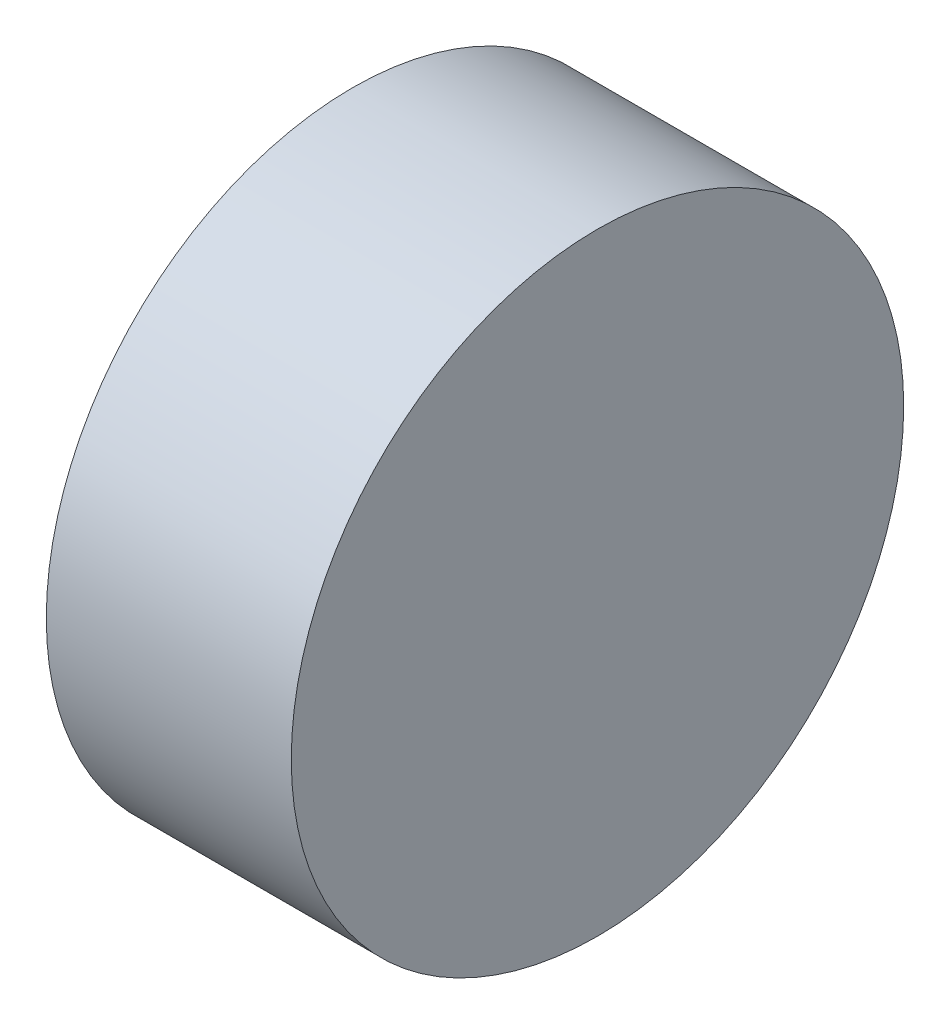
ISO-10303-21;
HEADER;
FILE_DESCRIPTION(('STEP AP214'),'2;1');
FILE_NAME('part.step','',(''),(''),'','','');
FILE_SCHEMA(('AUTOMOTIVE_DESIGN { 1 0 10303 214 1 1 1 1 }'));
ENDSEC;
DATA;
#1=APPLICATION_CONTEXT('core data for automotive mechanical design processes');
#2=APPLICATION_PROTOCOL_DEFINITION('international standard','automotive_design',2000,#1);
#3=PRODUCT_CONTEXT('',#1,'mechanical');
#4=PRODUCT('Part','Part','',(#3));
#5=PRODUCT_RELATED_PRODUCT_CATEGORY('part','',(#4));
#6=PRODUCT_DEFINITION_FORMATION('','',#4);
#7=PRODUCT_DEFINITION_CONTEXT('part definition',#1,'design');
#8=PRODUCT_DEFINITION('design','',#6,#7);
#9=PRODUCT_DEFINITION_SHAPE('','',#8);
#10=(LENGTH_UNIT() NAMED_UNIT(*) SI_UNIT(.MILLI.,.METRE.));
#11=(NAMED_UNIT(*) PLANE_ANGLE_UNIT() SI_UNIT($,.RADIAN.));
#12=(NAMED_UNIT(*) SI_UNIT($,.STERADIAN.) SOLID_ANGLE_UNIT());
#13=UNCERTAINTY_MEASURE_WITH_UNIT(LENGTH_MEASURE(1.E-05),#10,'distance_accuracy_value','');
#14=(GEOMETRIC_REPRESENTATION_CONTEXT(3) GLOBAL_UNCERTAINTY_ASSIGNED_CONTEXT((#13)) GLOBAL_UNIT_ASSIGNED_CONTEXT((#10,
#11,#12)) REPRESENTATION_CONTEXT('',''));
#15=CARTESIAN_POINT('',(0.,0.,0.));
#16=DIRECTION('',(0.,0.,1.));
#17=DIRECTION('',(1.,0.,0.));
#18=AXIS2_PLACEMENT_3D('',#15,#16,#17);
#19=CARTESIAN_POINT('',(-5.37234042553191,-15.9308510638298,0.));
#20=DIRECTION('',(1.,0.,0.));
#21=DIRECTION('',(0.,0.,-1.));
#22=AXIS2_PLACEMENT_3D('',#19,#20,#21);
#23=PLANE('',#22);
#24=CARTESIAN_POINT('',(-5.37234042553191,9.06914893617021,0.));
#25=DIRECTION('',(1.,0.,0.));
#26=DIRECTION('',(0.,0.,-1.));
#27=AXIS2_PLACEMENT_3D('',#24,#25,#26);
#28=CIRCLE('',#27,25.);
#29=CARTESIAN_POINT('',(-5.37234042553191,9.06914893617021,-25.));
#30=VERTEX_POINT('',#29);
#31=EDGE_CURVE('E10',#30,#30,#28,.T.);
#32=ORIENTED_EDGE('',*,*,#31,.F.);
#33=EDGE_LOOP('',(#32));
#34=FACE_BOUND('',#33,.T.);
#35=ADVANCED_FACE('F32',(#34),#23,.F.);
#36=CARTESIAN_POINT('',(14.6276595744681,9.06914893617021,0.));
#37=DIRECTION('',(1.,0.,0.));
#38=DIRECTION('',(0.,0.,-1.));
#39=AXIS2_PLACEMENT_3D('',#36,#37,#38);
#40=CYLINDRICAL_SURFACE('',#39,25.);
#41=CARTESIAN_POINT('',(14.6276595744681,9.06914893617021,0.));
#42=DIRECTION('',(1.,0.,0.));
#43=DIRECTION('',(0.,0.,-1.));
#44=AXIS2_PLACEMENT_3D('',#41,#42,#43);
#45=CIRCLE('',#44,25.);
#46=CARTESIAN_POINT('',(14.6276595744681,9.06914893617021,-25.));
#47=VERTEX_POINT('',#46);
#48=EDGE_CURVE('E38',#47,#47,#45,.T.);
#49=ORIENTED_EDGE('',*,*,#48,.F.);
#50=EDGE_LOOP('',(#49));
#51=FACE_BOUND('',#50,.T.);
#52=ORIENTED_EDGE('',*,*,#31,.T.);
#53=EDGE_LOOP('',(#52));
#54=FACE_BOUND('',#53,.T.);
#55=ADVANCED_FACE('F46',(#51,#54),#40,.T.);
#56=CARTESIAN_POINT('',(14.6276595744681,-15.9308510638298,0.));
#57=DIRECTION('',(-1.,0.,0.));
#58=DIRECTION('',(0.,0.,1.));
#59=AXIS2_PLACEMENT_3D('',#56,#57,#58);
#60=PLANE('',#59);
#61=ORIENTED_EDGE('',*,*,#48,.T.);
#62=EDGE_LOOP('',(#61));
#63=FACE_BOUND('',#62,.T.);
#64=ADVANCED_FACE('F44',(#63),#60,.F.);
#65=CLOSED_SHELL('',(#35,#55,#64));
#66=MANIFOLD_SOLID_BREP('B2',#65);
#67=ADVANCED_BREP_SHAPE_REPRESENTATION('',(#18,#66),#14);
#68=SHAPE_DEFINITION_REPRESENTATION(#9,#67);
ENDSEC;
END-ISO-10303-21;
